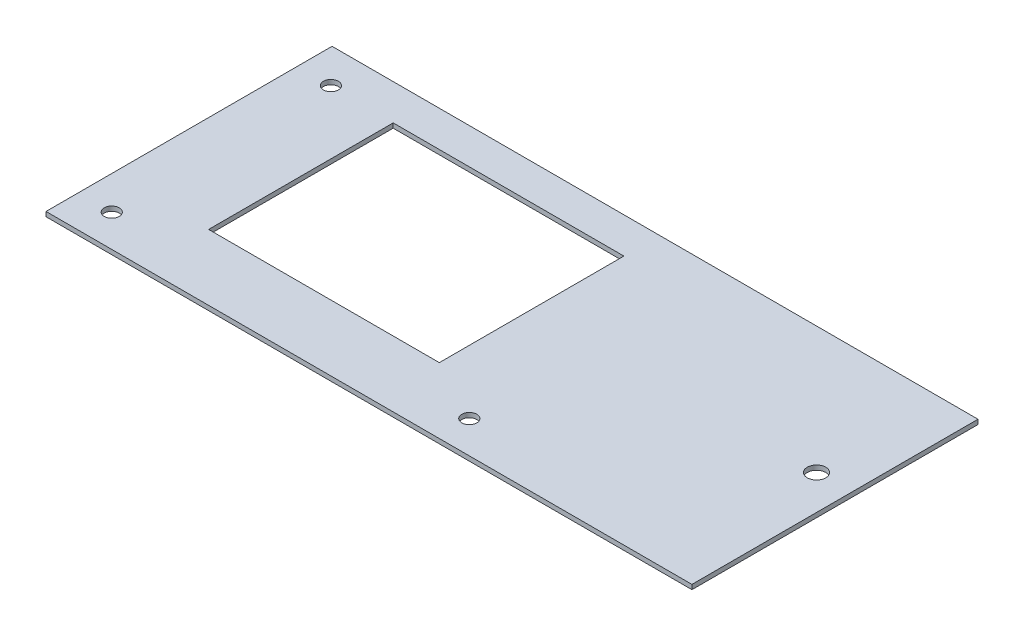
ISO-10303-21;
HEADER;
FILE_DESCRIPTION(('STEP AP214'),'2;1');
FILE_NAME('part.step','',(''),(''),'','','');
FILE_SCHEMA(('AUTOMOTIVE_DESIGN { 1 0 10303 214 1 1 1 1 }'));
ENDSEC;
DATA;
#1=APPLICATION_CONTEXT('core data for automotive mechanical design processes');
#2=APPLICATION_PROTOCOL_DEFINITION('international standard','automotive_design',2000,#1);
#3=PRODUCT_CONTEXT('',#1,'mechanical');
#4=PRODUCT('Part','Part','',(#3));
#5=PRODUCT_RELATED_PRODUCT_CATEGORY('part','',(#4));
#6=PRODUCT_DEFINITION_FORMATION('','',#4);
#7=PRODUCT_DEFINITION_CONTEXT('part definition',#1,'design');
#8=PRODUCT_DEFINITION('design','',#6,#7);
#9=PRODUCT_DEFINITION_SHAPE('','',#8);
#10=(LENGTH_UNIT() NAMED_UNIT(*) SI_UNIT(.MILLI.,.METRE.));
#11=(NAMED_UNIT(*) PLANE_ANGLE_UNIT() SI_UNIT($,.RADIAN.));
#12=(NAMED_UNIT(*) SI_UNIT($,.STERADIAN.) SOLID_ANGLE_UNIT());
#13=UNCERTAINTY_MEASURE_WITH_UNIT(LENGTH_MEASURE(1.E-05),#10,'distance_accuracy_value','');
#14=(GEOMETRIC_REPRESENTATION_CONTEXT(3) GLOBAL_UNCERTAINTY_ASSIGNED_CONTEXT((#13)) GLOBAL_UNIT_ASSIGNED_CONTEXT((#10,
#11,#12)) REPRESENTATION_CONTEXT('',''));
#15=CARTESIAN_POINT('',(0.,0.,0.));
#16=DIRECTION('',(0.,0.,1.));
#17=DIRECTION('',(1.,0.,0.));
#18=AXIS2_PLACEMENT_3D('',#15,#16,#17);
#19=CARTESIAN_POINT('',(188.,0.,-10.));
#20=DIRECTION('',(1.,0.,0.));
#21=DIRECTION('',(0.,0.,-1.));
#22=AXIS2_PLACEMENT_3D('',#19,#20,#21);
#23=PLANE('',#22);
#24=DIRECTION('',(0.,1.,0.));
#25=VECTOR('',#24,1.);
#26=CARTESIAN_POINT('',(188.,0.,114.));
#27=LINE('',#26,#25);
#28=CARTESIAN_POINT('',(188.,-2.,114.));
#29=VERTEX_POINT('',#28);
#30=CARTESIAN_POINT('',(188.,0.,114.));
#31=VERTEX_POINT('',#30);
#32=EDGE_CURVE('E11',#29,#31,#27,.T.);
#33=ORIENTED_EDGE('',*,*,#32,.F.);
#34=DIRECTION('',(0.,0.,1.));
#35=VECTOR('',#34,1.);
#36=CARTESIAN_POINT('',(188.,-2.,0.));
#37=LINE('',#36,#35);
#38=CARTESIAN_POINT('',(188.,-2.,-10.));
#39=VERTEX_POINT('',#38);
#40=EDGE_CURVE('E106',#29,#39,#37,.F.);
#41=ORIENTED_EDGE('',*,*,#40,.T.);
#42=DIRECTION('',(0.,1.,0.));
#43=VECTOR('',#42,1.);
#44=CARTESIAN_POINT('',(188.,0.,-10.));
#45=LINE('',#44,#43);
#46=CARTESIAN_POINT('',(188.,0.,-10.));
#47=VERTEX_POINT('',#46);
#48=EDGE_CURVE('E49',#39,#47,#45,.T.);
#49=ORIENTED_EDGE('',*,*,#48,.T.);
#50=DIRECTION('',(0.,0.,-1.));
#51=VECTOR('',#50,1.);
#52=CARTESIAN_POINT('',(188.,0.,-10.));
#53=LINE('',#52,#51);
#54=EDGE_CURVE('E136',#31,#47,#53,.T.);
#55=ORIENTED_EDGE('',*,*,#54,.F.);
#56=EDGE_LOOP('',(#33,#41,#49,#55));
#57=FACE_BOUND('',#56,.T.);
#58=ADVANCED_FACE('F39',(#57),#23,.T.);
#59=CARTESIAN_POINT('',(-92.,0.,-9.99999999999999));
#60=DIRECTION('',(0.,0.,-1.));
#61=DIRECTION('',(-1.,0.,0.));
#62=AXIS2_PLACEMENT_3D('',#59,#60,#61);
#63=PLANE('',#62);
#64=ORIENTED_EDGE('',*,*,#48,.F.);
#65=DIRECTION('',(1.,0.,0.));
#66=VECTOR('',#65,1.);
#67=CARTESIAN_POINT('',(0.,-2.,-10.));
#68=LINE('',#67,#66);
#69=CARTESIAN_POINT('',(-92.,-2.,-9.99999999999999));
#70=VERTEX_POINT('',#69);
#71=EDGE_CURVE('E118',#39,#70,#68,.F.);
#72=ORIENTED_EDGE('',*,*,#71,.T.);
#73=DIRECTION('',(0.,1.,0.));
#74=VECTOR('',#73,1.);
#75=CARTESIAN_POINT('',(-92.,0.,-9.99999999999999));
#76=LINE('',#75,#74);
#77=CARTESIAN_POINT('',(-92.,0.,-9.99999999999999));
#78=VERTEX_POINT('',#77);
#79=EDGE_CURVE('E57',#70,#78,#76,.T.);
#80=ORIENTED_EDGE('',*,*,#79,.T.);
#81=DIRECTION('',(-1.,0.,0.));
#82=VECTOR('',#81,1.);
#83=CARTESIAN_POINT('',(-92.,0.,-9.99999999999999));
#84=LINE('',#83,#82);
#85=EDGE_CURVE('E133',#47,#78,#84,.T.);
#86=ORIENTED_EDGE('',*,*,#85,.F.);
#87=EDGE_LOOP('',(#64,#72,#80,#86));
#88=FACE_BOUND('',#87,.T.);
#89=ADVANCED_FACE('F141',(#88),#63,.T.);
#90=CARTESIAN_POINT('',(-92.,0.,-9.99999999999999));
#91=DIRECTION('',(-1.,0.,0.));
#92=DIRECTION('',(0.,0.,1.));
#93=AXIS2_PLACEMENT_3D('',#90,#91,#92);
#94=PLANE('',#93);
#95=ORIENTED_EDGE('',*,*,#79,.F.);
#96=DIRECTION('',(0.,0.,1.));
#97=VECTOR('',#96,1.);
#98=CARTESIAN_POINT('',(-92.,-2.,0.));
#99=LINE('',#98,#97);
#100=CARTESIAN_POINT('',(-92.,-2.,114.));
#101=VERTEX_POINT('',#100);
#102=EDGE_CURVE('E105',#70,#101,#99,.T.);
#103=ORIENTED_EDGE('',*,*,#102,.T.);
#104=DIRECTION('',(0.,1.,0.));
#105=VECTOR('',#104,1.);
#106=CARTESIAN_POINT('',(-92.,0.,114.));
#107=LINE('',#106,#105);
#108=CARTESIAN_POINT('',(-92.,0.,114.));
#109=VERTEX_POINT('',#108);
#110=EDGE_CURVE('E43',#101,#109,#107,.T.);
#111=ORIENTED_EDGE('',*,*,#110,.T.);
#112=DIRECTION('',(0.,0.,1.));
#113=VECTOR('',#112,1.);
#114=CARTESIAN_POINT('',(-92.,0.,-9.99999999999999));
#115=LINE('',#114,#113);
#116=EDGE_CURVE('E197',#78,#109,#115,.T.);
#117=ORIENTED_EDGE('',*,*,#116,.F.);
#118=EDGE_LOOP('',(#95,#103,#111,#117));
#119=FACE_BOUND('',#118,.T.);
#120=ADVANCED_FACE('F108',(#119),#94,.T.);
#121=CARTESIAN_POINT('',(50.,0.,5.49999999999999));
#122=DIRECTION('',(1.,0.,0.));
#123=DIRECTION('',(0.,0.,-1.));
#124=AXIS2_PLACEMENT_3D('',#121,#122,#123);
#125=PLANE('',#124);
#126=DIRECTION('',(0.,1.,0.));
#127=VECTOR('',#126,1.);
#128=CARTESIAN_POINT('',(50.,0.,5.49999999999999));
#129=LINE('',#128,#127);
#130=CARTESIAN_POINT('',(50.,-2.,5.49999999999999));
#131=VERTEX_POINT('',#130);
#132=CARTESIAN_POINT('',(50.,0.,5.49999999999999));
#133=VERTEX_POINT('',#132);
#134=EDGE_CURVE('E100',#131,#133,#129,.T.);
#135=ORIENTED_EDGE('',*,*,#134,.F.);
#136=DIRECTION('',(0.,0.,1.));
#137=VECTOR('',#136,1.);
#138=CARTESIAN_POINT('',(50.,-2.,0.));
#139=LINE('',#138,#137);
#140=CARTESIAN_POINT('',(50.,-2.,85.5));
#141=VERTEX_POINT('',#140);
#142=EDGE_CURVE('E112',#141,#131,#139,.F.);
#143=ORIENTED_EDGE('',*,*,#142,.F.);
#144=DIRECTION('',(0.,1.,0.));
#145=VECTOR('',#144,1.);
#146=CARTESIAN_POINT('',(50.,0.,85.5));
#147=LINE('',#146,#145);
#148=CARTESIAN_POINT('',(50.,0.,85.5));
#149=VERTEX_POINT('',#148);
#150=EDGE_CURVE('E125',#141,#149,#147,.T.);
#151=ORIENTED_EDGE('',*,*,#150,.T.);
#152=DIRECTION('',(0.,0.,-1.));
#153=VECTOR('',#152,1.);
#154=CARTESIAN_POINT('',(50.,0.,5.49999999999999));
#155=LINE('',#154,#153);
#156=EDGE_CURVE('E193',#149,#133,#155,.T.);
#157=ORIENTED_EDGE('',*,*,#156,.T.);
#158=EDGE_LOOP('',(#135,#143,#151,#157));
#159=FACE_BOUND('',#158,.T.);
#160=ADVANCED_FACE('F195',(#159),#125,.F.);
#161=CARTESIAN_POINT('',(50.,0.,85.5));
#162=DIRECTION('',(0.,0.,1.));
#163=DIRECTION('',(1.,0.,0.));
#164=AXIS2_PLACEMENT_3D('',#161,#162,#163);
#165=PLANE('',#164);
#166=ORIENTED_EDGE('',*,*,#150,.F.);
#167=DIRECTION('',(1.,0.,0.));
#168=VECTOR('',#167,1.);
#169=CARTESIAN_POINT('',(0.,-2.,85.5));
#170=LINE('',#169,#168);
#171=CARTESIAN_POINT('',(-50.,-2.,85.5));
#172=VERTEX_POINT('',#171);
#173=EDGE_CURVE('E109',#172,#141,#170,.T.);
#174=ORIENTED_EDGE('',*,*,#173,.F.);
#175=DIRECTION('',(0.,1.,0.));
#176=VECTOR('',#175,1.);
#177=CARTESIAN_POINT('',(-50.,0.,85.5));
#178=LINE('',#177,#176);
#179=CARTESIAN_POINT('',(-50.,0.,85.5));
#180=VERTEX_POINT('',#179);
#181=EDGE_CURVE('E122',#172,#180,#178,.T.);
#182=ORIENTED_EDGE('',*,*,#181,.T.);
#183=DIRECTION('',(1.,0.,0.));
#184=VECTOR('',#183,1.);
#185=CARTESIAN_POINT('',(50.,0.,85.5));
#186=LINE('',#185,#184);
#187=EDGE_CURVE('E178',#180,#149,#186,.T.);
#188=ORIENTED_EDGE('',*,*,#187,.T.);
#189=EDGE_LOOP('',(#166,#174,#182,#188));
#190=FACE_BOUND('',#189,.T.);
#191=ADVANCED_FACE('F176',(#190),#165,.F.);
#192=CARTESIAN_POINT('',(-50.,0.,5.5));
#193=DIRECTION('',(-1.,0.,0.));
#194=DIRECTION('',(0.,0.,1.));
#195=AXIS2_PLACEMENT_3D('',#192,#193,#194);
#196=PLANE('',#195);
#197=ORIENTED_EDGE('',*,*,#181,.F.);
#198=DIRECTION('',(0.,0.,1.));
#199=VECTOR('',#198,1.);
#200=CARTESIAN_POINT('',(-50.,-2.,0.));
#201=LINE('',#200,#199);
#202=CARTESIAN_POINT('',(-50.,-2.,5.5));
#203=VERTEX_POINT('',#202);
#204=EDGE_CURVE('E157',#203,#172,#201,.T.);
#205=ORIENTED_EDGE('',*,*,#204,.F.);
#206=DIRECTION('',(0.,1.,0.));
#207=VECTOR('',#206,1.);
#208=CARTESIAN_POINT('',(-50.,0.,5.5));
#209=LINE('',#208,#207);
#210=CARTESIAN_POINT('',(-50.,0.,5.5));
#211=VERTEX_POINT('',#210);
#212=EDGE_CURVE('E126',#203,#211,#209,.T.);
#213=ORIENTED_EDGE('',*,*,#212,.T.);
#214=DIRECTION('',(0.,0.,1.));
#215=VECTOR('',#214,1.);
#216=CARTESIAN_POINT('',(-50.,0.,5.5));
#217=LINE('',#216,#215);
#218=EDGE_CURVE('E172',#211,#180,#217,.T.);
#219=ORIENTED_EDGE('',*,*,#218,.T.);
#220=EDGE_LOOP('',(#197,#205,#213,#219));
#221=FACE_BOUND('',#220,.T.);
#222=ADVANCED_FACE('F168',(#221),#196,.F.);
#223=CARTESIAN_POINT('',(-77.5,0.,100.));
#224=DIRECTION('',(0.,1.,0.));
#225=DIRECTION('',(0.,0.,1.));
#226=AXIS2_PLACEMENT_3D('',#223,#224,#225);
#227=CYLINDRICAL_SURFACE('',#226,3.25);
#228=CARTESIAN_POINT('',(-77.5,0.,100.));
#229=DIRECTION('',(0.,1.,0.));
#230=DIRECTION('',(0.,0.,1.));
#231=AXIS2_PLACEMENT_3D('',#228,#229,#230);
#232=CIRCLE('',#231,3.25);
#233=CARTESIAN_POINT('',(-77.5,0.,103.25));
#234=VERTEX_POINT('',#233);
#235=EDGE_CURVE('E120',#234,#234,#232,.T.);
#236=ORIENTED_EDGE('',*,*,#235,.T.);
#237=EDGE_LOOP('',(#236));
#238=FACE_BOUND('',#237,.T.);
#239=CARTESIAN_POINT('',(-77.5,-2.,100.));
#240=DIRECTION('',(0.,1.,0.));
#241=DIRECTION('',(0.,0.,1.));
#242=AXIS2_PLACEMENT_3D('',#239,#240,#241);
#243=CIRCLE('',#242,3.25);
#244=CARTESIAN_POINT('',(-77.5,-2.,103.25));
#245=VERTEX_POINT('',#244);
#246=EDGE_CURVE('E145',#245,#245,#243,.T.);
#247=ORIENTED_EDGE('',*,*,#246,.F.);
#248=EDGE_LOOP('',(#247));
#249=FACE_BOUND('',#248,.T.);
#250=ADVANCED_FACE('F214',(#238,#249),#227,.F.);
#251=CARTESIAN_POINT('',(-77.5,0.,5.00000000000001));
#252=DIRECTION('',(0.,1.,0.));
#253=DIRECTION('',(0.,0.,1.));
#254=AXIS2_PLACEMENT_3D('',#251,#252,#253);
#255=CYLINDRICAL_SURFACE('',#254,3.25);
#256=CARTESIAN_POINT('',(-77.5,0.,5.00000000000001));
#257=DIRECTION('',(0.,1.,0.));
#258=DIRECTION('',(0.,0.,1.));
#259=AXIS2_PLACEMENT_3D('',#256,#257,#258);
#260=CIRCLE('',#259,3.25);
#261=CARTESIAN_POINT('',(-77.5,0.,8.25000000000001));
#262=VERTEX_POINT('',#261);
#263=EDGE_CURVE('E208',#262,#262,#260,.T.);
#264=ORIENTED_EDGE('',*,*,#263,.T.);
#265=EDGE_LOOP('',(#264));
#266=FACE_BOUND('',#265,.T.);
#267=CARTESIAN_POINT('',(-77.5,-2.,5.00000000000001));
#268=DIRECTION('',(0.,1.,0.));
#269=DIRECTION('',(0.,0.,1.));
#270=AXIS2_PLACEMENT_3D('',#267,#268,#269);
#271=CIRCLE('',#270,3.25);
#272=CARTESIAN_POINT('',(-77.5,-2.,8.25000000000001));
#273=VERTEX_POINT('',#272);
#274=EDGE_CURVE('E148',#273,#273,#271,.T.);
#275=ORIENTED_EDGE('',*,*,#274,.F.);
#276=EDGE_LOOP('',(#275));
#277=FACE_BOUND('',#276,.T.);
#278=ADVANCED_FACE('F258',(#266,#277),#255,.F.);
#279=CARTESIAN_POINT('',(77.5,0.,100.));
#280=DIRECTION('',(0.,1.,0.));
#281=DIRECTION('',(0.,0.,1.));
#282=AXIS2_PLACEMENT_3D('',#279,#280,#281);
#283=CYLINDRICAL_SURFACE('',#282,3.25);
#284=CARTESIAN_POINT('',(77.5,0.,100.));
#285=DIRECTION('',(0.,1.,0.));
#286=DIRECTION('',(0.,0.,1.));
#287=AXIS2_PLACEMENT_3D('',#284,#285,#286);
#288=CIRCLE('',#287,3.25);
#289=CARTESIAN_POINT('',(77.5,0.,103.25));
#290=VERTEX_POINT('',#289);
#291=EDGE_CURVE('E205',#290,#290,#288,.T.);
#292=ORIENTED_EDGE('',*,*,#291,.T.);
#293=EDGE_LOOP('',(#292));
#294=FACE_BOUND('',#293,.T.);
#295=CARTESIAN_POINT('',(77.5,-2.,100.));
#296=DIRECTION('',(0.,1.,0.));
#297=DIRECTION('',(0.,0.,1.));
#298=AXIS2_PLACEMENT_3D('',#295,#296,#297);
#299=CIRCLE('',#298,3.25);
#300=CARTESIAN_POINT('',(77.5,-2.,103.25));
#301=VERTEX_POINT('',#300);
#302=EDGE_CURVE('E151',#301,#301,#299,.T.);
#303=ORIENTED_EDGE('',*,*,#302,.F.);
#304=EDGE_LOOP('',(#303));
#305=FACE_BOUND('',#304,.T.);
#306=ADVANCED_FACE('F229',(#294,#305),#283,.F.);
#307=CARTESIAN_POINT('',(173.,0.,45.));
#308=DIRECTION('',(0.,1.,0.));
#309=DIRECTION('',(0.,0.,1.));
#310=AXIS2_PLACEMENT_3D('',#307,#308,#309);
#311=CYLINDRICAL_SURFACE('',#310,3.99999999999998);
#312=CARTESIAN_POINT('',(173.,0.,45.));
#313=DIRECTION('',(0.,1.,0.));
#314=DIRECTION('',(0.,0.,1.));
#315=AXIS2_PLACEMENT_3D('',#312,#313,#314);
#316=CIRCLE('',#315,3.99999999999998);
#317=CARTESIAN_POINT('',(173.,0.,49.));
#318=VERTEX_POINT('',#317);
#319=EDGE_CURVE('E202',#318,#318,#316,.T.);
#320=ORIENTED_EDGE('',*,*,#319,.T.);
#321=EDGE_LOOP('',(#320));
#322=FACE_BOUND('',#321,.T.);
#323=CARTESIAN_POINT('',(173.,-2.,45.));
#324=DIRECTION('',(0.,1.,0.));
#325=DIRECTION('',(0.,0.,1.));
#326=AXIS2_PLACEMENT_3D('',#323,#324,#325);
#327=CIRCLE('',#326,3.99999999999998);
#328=CARTESIAN_POINT('',(173.,-2.,49.));
#329=VERTEX_POINT('',#328);
#330=EDGE_CURVE('E154',#329,#329,#327,.T.);
#331=ORIENTED_EDGE('',*,*,#330,.F.);
#332=EDGE_LOOP('',(#331));
#333=FACE_BOUND('',#332,.T.);
#334=ADVANCED_FACE('F226',(#322,#333),#311,.F.);
#335=CARTESIAN_POINT('',(50.,0.,5.49999999999999));
#336=DIRECTION('',(0.,0.,-1.));
#337=DIRECTION('',(-1.,0.,0.));
#338=AXIS2_PLACEMENT_3D('',#335,#336,#337);
#339=PLANE('',#338);
#340=DIRECTION('',(1.,0.,0.));
#341=VECTOR('',#340,1.);
#342=CARTESIAN_POINT('',(0.,-2.,5.49999999999999));
#343=LINE('',#342,#341);
#344=EDGE_CURVE('E116',#131,#203,#343,.F.);
#345=ORIENTED_EDGE('',*,*,#344,.F.);
#346=ORIENTED_EDGE('',*,*,#134,.T.);
#347=DIRECTION('',(-1.,0.,0.));
#348=VECTOR('',#347,1.);
#349=CARTESIAN_POINT('',(50.,0.,5.49999999999999));
#350=LINE('',#349,#348);
#351=EDGE_CURVE('E188',#133,#211,#350,.T.);
#352=ORIENTED_EDGE('',*,*,#351,.T.);
#353=ORIENTED_EDGE('',*,*,#212,.F.);
#354=EDGE_LOOP('',(#345,#346,#352,#353));
#355=FACE_BOUND('',#354,.T.);
#356=ADVANCED_FACE('F187',(#355),#339,.F.);
#357=CARTESIAN_POINT('',(-92.,0.,114.));
#358=DIRECTION('',(0.,0.,1.));
#359=DIRECTION('',(1.,0.,0.));
#360=AXIS2_PLACEMENT_3D('',#357,#358,#359);
#361=PLANE('',#360);
#362=DIRECTION('',(1.,0.,0.));
#363=VECTOR('',#362,1.);
#364=CARTESIAN_POINT('',(0.,-2.,114.));
#365=LINE('',#364,#363);
#366=EDGE_CURVE('E93',#101,#29,#365,.T.);
#367=ORIENTED_EDGE('',*,*,#366,.T.);
#368=ORIENTED_EDGE('',*,*,#32,.T.);
#369=DIRECTION('',(1.,0.,0.));
#370=VECTOR('',#369,1.);
#371=CARTESIAN_POINT('',(-92.,0.,114.));
#372=LINE('',#371,#370);
#373=EDGE_CURVE('E96',#109,#31,#372,.T.);
#374=ORIENTED_EDGE('',*,*,#373,.F.);
#375=ORIENTED_EDGE('',*,*,#110,.F.);
#376=EDGE_LOOP('',(#367,#368,#374,#375));
#377=FACE_BOUND('',#376,.T.);
#378=ADVANCED_FACE('F41',(#377),#361,.T.);
#379=CARTESIAN_POINT('',(0.,0.,0.));
#380=DIRECTION('',(0.,1.,0.));
#381=DIRECTION('',(0.,0.,1.));
#382=AXIS2_PLACEMENT_3D('',#379,#380,#381);
#383=PLANE('',#382);
#384=ORIENTED_EDGE('',*,*,#235,.F.);
#385=EDGE_LOOP('',(#384));
#386=FACE_BOUND('',#385,.T.);
#387=ORIENTED_EDGE('',*,*,#263,.F.);
#388=EDGE_LOOP('',(#387));
#389=FACE_BOUND('',#388,.T.);
#390=ORIENTED_EDGE('',*,*,#291,.F.);
#391=EDGE_LOOP('',(#390));
#392=FACE_BOUND('',#391,.T.);
#393=ORIENTED_EDGE('',*,*,#319,.F.);
#394=EDGE_LOOP('',(#393));
#395=FACE_BOUND('',#394,.T.);
#396=ORIENTED_EDGE('',*,*,#218,.F.);
#397=ORIENTED_EDGE('',*,*,#351,.F.);
#398=ORIENTED_EDGE('',*,*,#156,.F.);
#399=ORIENTED_EDGE('',*,*,#187,.F.);
#400=EDGE_LOOP('',(#396,#397,#398,#399));
#401=FACE_BOUND('',#400,.T.);
#402=ORIENTED_EDGE('',*,*,#116,.T.);
#403=ORIENTED_EDGE('',*,*,#373,.T.);
#404=ORIENTED_EDGE('',*,*,#54,.T.);
#405=ORIENTED_EDGE('',*,*,#85,.T.);
#406=EDGE_LOOP('',(#402,#403,#404,#405));
#407=FACE_BOUND('',#406,.T.);
#408=ADVANCED_FACE('F139',(#386,#389,#392,#395,#401,#407),#383,.T.);
#409=CARTESIAN_POINT('',(0.,-2.,0.));
#410=DIRECTION('',(0.,1.,0.));
#411=DIRECTION('',(0.,0.,1.));
#412=AXIS2_PLACEMENT_3D('',#409,#410,#411);
#413=PLANE('',#412);
#414=ORIENTED_EDGE('',*,*,#246,.T.);
#415=EDGE_LOOP('',(#414));
#416=FACE_BOUND('',#415,.T.);
#417=ORIENTED_EDGE('',*,*,#274,.T.);
#418=EDGE_LOOP('',(#417));
#419=FACE_BOUND('',#418,.T.);
#420=ORIENTED_EDGE('',*,*,#302,.T.);
#421=EDGE_LOOP('',(#420));
#422=FACE_BOUND('',#421,.T.);
#423=ORIENTED_EDGE('',*,*,#330,.T.);
#424=EDGE_LOOP('',(#423));
#425=FACE_BOUND('',#424,.T.);
#426=ORIENTED_EDGE('',*,*,#204,.T.);
#427=ORIENTED_EDGE('',*,*,#173,.T.);
#428=ORIENTED_EDGE('',*,*,#142,.T.);
#429=ORIENTED_EDGE('',*,*,#344,.T.);
#430=EDGE_LOOP('',(#426,#427,#428,#429));
#431=FACE_BOUND('',#430,.T.);
#432=ORIENTED_EDGE('',*,*,#102,.F.);
#433=ORIENTED_EDGE('',*,*,#71,.F.);
#434=ORIENTED_EDGE('',*,*,#40,.F.);
#435=ORIENTED_EDGE('',*,*,#366,.F.);
#436=EDGE_LOOP('',(#432,#433,#434,#435));
#437=FACE_BOUND('',#436,.T.);
#438=ADVANCED_FACE('F103',(#416,#419,#422,#425,#431,#437),#413,.F.);
#439=CLOSED_SHELL('',(#58,#89,#120,#160,#191,#222,#250,#278,#306,#334,#356,#378,#408,#438));
#440=MANIFOLD_SOLID_BREP('B2',#439);
#441=ADVANCED_BREP_SHAPE_REPRESENTATION('',(#18,#440),#14);
#442=SHAPE_DEFINITION_REPRESENTATION(#9,#441);
ENDSEC;
END-ISO-10303-21;
